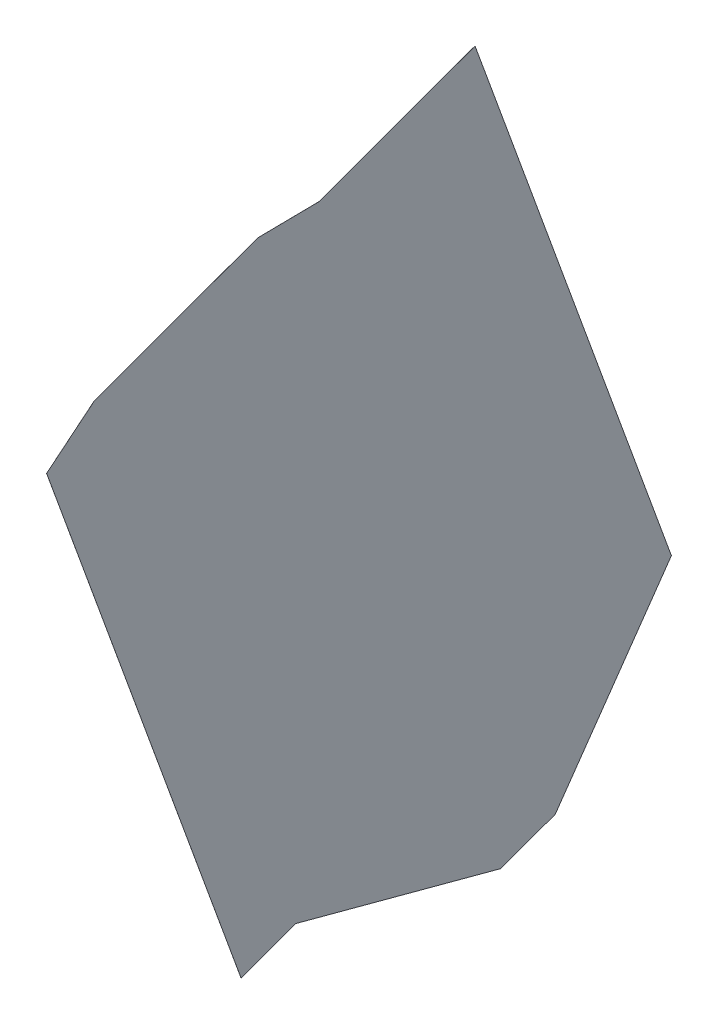
ISO-10303-21;
HEADER;
FILE_DESCRIPTION(('STEP AP214'),'2;1');
FILE_NAME('part.step','',(''),(''),'','','');
FILE_SCHEMA(('AUTOMOTIVE_DESIGN { 1 0 10303 214 1 1 1 1 }'));
ENDSEC;
DATA;
#1=APPLICATION_CONTEXT('core data for automotive mechanical design processes');
#2=APPLICATION_PROTOCOL_DEFINITION('international standard','automotive_design',2000,#1);
#3=PRODUCT_CONTEXT('',#1,'mechanical');
#4=PRODUCT('Part','Part','',(#3));
#5=PRODUCT_RELATED_PRODUCT_CATEGORY('part','',(#4));
#6=PRODUCT_DEFINITION_FORMATION('','',#4);
#7=PRODUCT_DEFINITION_CONTEXT('part definition',#1,'design');
#8=PRODUCT_DEFINITION('design','',#6,#7);
#9=PRODUCT_DEFINITION_SHAPE('','',#8);
#10=(LENGTH_UNIT() NAMED_UNIT(*) SI_UNIT(.MILLI.,.METRE.));
#11=(NAMED_UNIT(*) PLANE_ANGLE_UNIT() SI_UNIT($,.RADIAN.));
#12=(NAMED_UNIT(*) SI_UNIT($,.STERADIAN.) SOLID_ANGLE_UNIT());
#13=UNCERTAINTY_MEASURE_WITH_UNIT(LENGTH_MEASURE(1.E-05),#10,'distance_accuracy_value','');
#14=(GEOMETRIC_REPRESENTATION_CONTEXT(3) GLOBAL_UNCERTAINTY_ASSIGNED_CONTEXT((#13)) GLOBAL_UNIT_ASSIGNED_CONTEXT((#10,
#11,#12)) REPRESENTATION_CONTEXT('',''));
#15=CARTESIAN_POINT('',(0.,0.,0.));
#16=DIRECTION('',(0.,0.,1.));
#17=DIRECTION('',(1.,0.,0.));
#18=AXIS2_PLACEMENT_3D('',#15,#16,#17);
#19=CARTESIAN_POINT('',(140.002211031102,245.581163464748,379.425064512277));
#20=DIRECTION('',(4.24461743529474E-10,0.93968845337996,0.342031592962375));
#21=DIRECTION('',(3.48372728310009E-05,-0.342031592754838,0.939688452809735));
#22=AXIS2_PLACEMENT_3D('',#19,#20,#21);
#23=PLANE('',#22);
#24=DIRECTION('',(-0.999999999393183,-1.19150490591746E-05,3.27363282058429E-05));
#25=VECTOR('',#24,1.);
#26=CARTESIAN_POINT('',(140.004864932661,219.525215240095,451.010479989568));
#27=LINE('',#26,#25);
#28=CARTESIAN_POINT('',(140.014864932655,219.525215359245,451.010479662205));
#29=VERTEX_POINT('',#28);
#30=CARTESIAN_POINT('',(140.004864932661,219.525215240095,451.010479989568));
#31=VERTEX_POINT('',#30);
#32=EDGE_CURVE('E301',#29,#31,#27,.T.);
#33=ORIENTED_EDGE('',*,*,#32,.F.);
#34=DIRECTION('',(3.48372728310009E-05,-0.342031592754838,0.939688452809735));
#35=VECTOR('',#34,1.);
#36=CARTESIAN_POINT('',(140.012211031096,245.581163583898,379.425064184914));
#37=LINE('',#36,#35);
#38=CARTESIAN_POINT('',(140.012211725956,245.574341465387,379.443807090903));
#39=VERTEX_POINT('',#38);
#40=EDGE_CURVE('E291',#39,#29,#37,.T.);
#41=ORIENTED_EDGE('',*,*,#40,.F.);
#42=DIRECTION('',(-0.999999999393183,-1.19150489253927E-05,3.273632792683E-05));
#43=VECTOR('',#42,1.);
#44=CARTESIAN_POINT('',(140.002211725962,245.574341346237,379.443807418266));
#45=LINE('',#44,#43);
#46=CARTESIAN_POINT('',(140.002211725962,245.574341346237,379.443807418266));
#47=VERTEX_POINT('',#46);
#48=EDGE_CURVE('E304',#39,#47,#45,.T.);
#49=ORIENTED_EDGE('',*,*,#48,.T.);
#50=DIRECTION('',(3.48372728310009E-05,-0.342031592754838,0.939688452809735));
#51=VECTOR('',#50,1.);
#52=CARTESIAN_POINT('',(140.002211031102,245.581163464748,379.425064512277));
#53=LINE('',#52,#51);
#54=EDGE_CURVE('E290',#47,#31,#53,.T.);
#55=ORIENTED_EDGE('',*,*,#54,.T.);
#56=EDGE_LOOP('',(#33,#41,#49,#55));
#57=FACE_BOUND('',#56,.T.);
#58=ADVANCED_FACE('F52',(#57),#23,.T.);
#59=CARTESIAN_POINT('',(140.007230519492,-1.25960326254532,442.913203080727));
#60=DIRECTION('',(1.99802265898885E-05,-0.965940446549184,0.258764474611865));
#61=DIRECTION('',(-2.8538152075791E-05,-0.258764475108921,-0.965940446201099));
#62=AXIS2_PLACEMENT_3D('',#59,#60,#61);
#63=PLANE('',#62);
#64=DIRECTION('',(-0.999999999393183,-1.19150490591746E-05,3.27363282058429E-05));
#65=VECTOR('',#64,1.);
#66=CARTESIAN_POINT('',(140.002211725966,-46.7665957623939,273.040408053237));
#67=LINE('',#66,#65);
#68=CARTESIAN_POINT('',(140.01221172596,-46.7665956432434,273.040407725874));
#69=VERTEX_POINT('',#68);
#70=CARTESIAN_POINT('',(140.002211725966,-46.7665957623939,273.040408053237));
#71=VERTEX_POINT('',#70);
#72=EDGE_CURVE('E307',#69,#71,#67,.T.);
#73=ORIENTED_EDGE('',*,*,#72,.F.);
#74=DIRECTION('',(-2.8538152075791E-05,-0.258764475108921,-0.965940446201099));
#75=VECTOR('',#74,1.);
#76=CARTESIAN_POINT('',(140.017230519486,-1.25960314339485,442.913202753364));
#77=LINE('',#76,#75);
#78=CARTESIAN_POINT('',(140.014864932658,-22.7091291039954,362.8443885606));
#79=VERTEX_POINT('',#78);
#80=EDGE_CURVE('E282',#79,#69,#77,.T.);
#81=ORIENTED_EDGE('',*,*,#80,.F.);
#82=DIRECTION('',(-0.999999999393183,-1.19150502450593E-05,3.27363281499987E-05));
#83=VECTOR('',#82,1.);
#84=CARTESIAN_POINT('',(140.004864932664,-22.7091292231458,362.844388887963));
#85=LINE('',#84,#83);
#86=CARTESIAN_POINT('',(140.004864932664,-22.7091292231458,362.844388887963));
#87=VERTEX_POINT('',#86);
#88=EDGE_CURVE('E294',#79,#87,#85,.T.);
#89=ORIENTED_EDGE('',*,*,#88,.T.);
#90=DIRECTION('',(-2.8538152075791E-05,-0.258764475108921,-0.965940446201099));
#91=VECTOR('',#90,1.);
#92=CARTESIAN_POINT('',(140.007230519492,-1.25960326254532,442.913203080727));
#93=LINE('',#92,#91);
#94=EDGE_CURVE('E287',#87,#71,#93,.T.);
#95=ORIENTED_EDGE('',*,*,#94,.T.);
#96=EDGE_LOOP('',(#73,#81,#89,#95));
#97=FACE_BOUND('',#96,.T.);
#98=ADVANCED_FACE('F335',(#97),#63,.T.);
#99=CARTESIAN_POINT('',(140.001327307801,250.082815046131,354.068344712773));
#100=DIRECTION('',(0.999999999393183,1.19150490591161E-05,-3.27363282059733E-05));
#101=DIRECTION('',(-3.27363282082958E-05,0.,-0.999999999464166));
#102=AXIS2_PLACEMENT_3D('',#99,#100,#101);
#103=PLANE('',#102);
#104=ORIENTED_EDGE('',*,*,#54,.F.);
#105=DIRECTION('',(-3.33966870064289E-05,0.0604461376761188,-0.998171459882871));
#106=VECTOR('',#105,1.);
#107=CARTESIAN_POINT('',(140.002211725962,245.574341346237,379.443807418266));
#108=LINE('',#107,#106);
#109=CARTESIAN_POINT('',(140.002210905128,245.575827009733,379.419274057531));
#110=VERTEX_POINT('',#109);
#111=EDGE_CURVE('E234',#47,#110,#108,.T.);
#112=ORIENTED_EDGE('',*,*,#111,.T.);
#113=DIRECTION('',(3.28839724955954E-05,-0.0126098572843799,0.999920492048199));
#114=VECTOR('',#113,1.);
#115=CARTESIAN_POINT('',(140.001374953027,245.896385503545,354.000032615381));
#116=LINE('',#115,#114);
#117=CARTESIAN_POINT('',(140.001327431889,245.914608203497,352.555032034378));
#118=VERTEX_POINT('',#117);
#119=EDGE_CURVE('E226',#118,#110,#116,.T.);
#120=ORIENTED_EDGE('',*,*,#119,.F.);
#121=DIRECTION('',(-3.33964975428604E-05,0.0604271628627157,-0.998172608757141));
#122=VECTOR('',#121,1.);
#123=CARTESIAN_POINT('',(140.001327431889,245.914608203497,352.555032034378));
#124=LINE('',#123,#122);
#125=CARTESIAN_POINT('',(140.001326611055,245.916093409006,352.53049850695));
#126=VERTEX_POINT('',#125);
#127=EDGE_CURVE('E207',#118,#126,#124,.T.);
#128=ORIENTED_EDGE('',*,*,#127,.T.);
#129=DIRECTION('',(3.48372728311041E-05,-0.342008693430631,0.939696787482131));
#130=VECTOR('',#129,1.);
#131=CARTESIAN_POINT('',(140.001327309686,245.909234726901,352.549343295589));
#132=LINE('',#131,#130);
#133=CARTESIAN_POINT('',(139.998796306556,270.756905147957,284.27834165271));
#134=VERTEX_POINT('',#133);
#135=EDGE_CURVE('E187',#134,#126,#132,.T.);
#136=ORIENTED_EDGE('',*,*,#135,.F.);
#137=DIRECTION('',(0.,0.939692620785909,0.342020143325667));
#138=VECTOR('',#137,1.);
#139=CARTESIAN_POINT('',(139.998796306559,-30.3980769516625,174.666892267478));
#140=LINE('',#139,#138);
#141=CARTESIAN_POINT('',(139.998796306559,34.5489302580996,198.305669696504));
#142=VERTEX_POINT('',#141);
#143=EDGE_CURVE('E177',#142,#134,#140,.T.);
#144=ORIENTED_EDGE('',*,*,#143,.F.);
#145=DIRECTION('',(-2.85381520898877E-05,0.81911963874694,-0.573622712769165));
#146=VECTOR('',#145,1.);
#147=CARTESIAN_POINT('',(139.99630780739,105.975367868435,148.286325796808));
#148=LINE('',#147,#146);
#149=CARTESIAN_POINT('',(140.001326611059,-38.0774297678632,249.165309346181));
#150=VERTEX_POINT('',#149);
#151=EDGE_CURVE('E172',#150,#142,#148,.T.);
#152=ORIENTED_EDGE('',*,*,#151,.F.);
#153=DIRECTION('',(2.99482548936302E-05,-0.774077010630948,0.63309144735635));
#154=VECTOR('',#153,1.);
#155=CARTESIAN_POINT('',(140.001326611059,-38.0774297678632,249.165309346181));
#156=LINE('',#155,#154);
#157=CARTESIAN_POINT('',(140.001327431893,-38.0986459841152,249.182661373007));
#158=VERTEX_POINT('',#157);
#159=EDGE_CURVE('E204',#150,#158,#156,.T.);
#160=ORIENTED_EDGE('',*,*,#159,.T.);
#161=DIRECTION('',(-3.48372728232373E-05,0.341997223548684,-0.93970096194021));
#162=VECTOR('',#161,1.);
#163=CARTESIAN_POINT('',(140.001326995727,-38.0943641523678,249.170896244126));
#164=LINE('',#163,#162);
#165=CARTESIAN_POINT('',(140.002210905132,-46.7716955758896,273.013477774899));
#166=VERTEX_POINT('',#165);
#167=EDGE_CURVE('E215',#166,#158,#164,.T.);
#168=ORIENTED_EDGE('',*,*,#167,.F.);
#169=DIRECTION('',(2.99477106180945E-05,0.186064119653789,0.982537603596216));
#170=VECTOR('',#169,1.);
#171=CARTESIAN_POINT('',(140.002210905132,-46.7716955758897,273.0134777749));
#172=LINE('',#171,#170);
#173=EDGE_CURVE('E231',#166,#71,#172,.T.);
#174=ORIENTED_EDGE('',*,*,#173,.T.);
#175=ORIENTED_EDGE('',*,*,#94,.F.);
#176=DIRECTION('',(2.99482548815622E-05,0.186034054389951,0.982543296608521));
#177=VECTOR('',#176,1.);
#178=CARTESIAN_POINT('',(140.004864932664,-22.7091292231457,362.844388887963));
#179=LINE('',#178,#177);
#180=CARTESIAN_POINT('',(140.004865753498,-22.704030326429,362.871318832621));
#181=VERTEX_POINT('',#180);
#182=EDGE_CURVE('E275',#87,#181,#179,.T.);
#183=ORIENTED_EDGE('',*,*,#182,.T.);
#184=DIRECTION('',(-3.48372728231147E-05,0.342043062484098,-0.939684277932149));
#185=VECTOR('',#184,1.);
#186=CARTESIAN_POINT('',(140.005749708233,-31.3829698699853,386.714699777039));
#187=LINE('',#186,#185);
#188=CARTESIAN_POINT('',(140.005749923483,-31.3850832548575,386.720505813633));
#189=VERTEX_POINT('',#188);
#190=EDGE_CURVE('E262',#189,#181,#187,.T.);
#191=ORIENTED_EDGE('',*,*,#190,.F.);
#192=DIRECTION('',(0.,-0.93969262078591,-0.342020143325667));
#193=VECTOR('',#192,1.);
#194=CARTESIAN_POINT('',(140.005749923479,206.663123308001,473.362967322966));
#195=LINE('',#194,#193);
#196=CARTESIAN_POINT('',(140.005749923479,202.488689032755,471.843597501875));
#197=VERTEX_POINT('',#196);
#198=EDGE_CURVE('E267',#197,#189,#195,.T.);
#199=ORIENTED_EDGE('',*,*,#198,.F.);
#200=DIRECTION('',(3.28839725035474E-05,-0.633076791859025,0.774088996516635));
#201=VECTOR('',#200,1.);
#202=CARTESIAN_POINT('',(140.005701695517,203.417165785611,470.708310839736));
#203=LINE('',#202,#201);
#204=CARTESIAN_POINT('',(140.004865753495,219.510583126069,451.030228433624));
#205=VERTEX_POINT('',#204);
#206=EDGE_CURVE('E243',#205,#197,#203,.T.);
#207=ORIENTED_EDGE('',*,*,#206,.F.);
#208=DIRECTION('',(-3.33964975489653E-05,0.595323092897833,-0.803486411799996));
#209=VECTOR('',#208,1.);
#210=CARTESIAN_POINT('',(140.004865753495,219.510583126069,451.030228433624));
#211=LINE('',#210,#209);
#212=EDGE_CURVE('E278',#205,#31,#211,.T.);
#213=ORIENTED_EDGE('',*,*,#212,.T.);
#214=EDGE_LOOP('',(#104,#112,#120,#128,#136,#144,#152,#160,#168,#174,#175,#183,#191,#199,#207,#213));
#215=FACE_BOUND('',#214,.T.);
#216=ADVANCED_FACE('F54',(#215),#103,.F.);
#217=CARTESIAN_POINT('',(140.01221102921,241.406747821996,377.905643500755));
#218=DIRECTION('',(0.999999999393183,1.19150490591746E-05,-3.27363282058429E-05));
#219=DIRECTION('',(-3.27363282165427E-05,0.642787609342109,-0.766044442708508));
#220=AXIS2_PLACEMENT_3D('',#217,#218,#219);
#221=PLANE('',#220);
#222=ORIENTED_EDGE('',*,*,#40,.T.);
#223=DIRECTION('',(-3.33964975489653E-05,0.595323092897833,-0.803486411799996));
#224=VECTOR('',#223,1.);
#225=CARTESIAN_POINT('',(140.014865753489,219.51058324522,451.030228106261));
#226=LINE('',#225,#224);
#227=CARTESIAN_POINT('',(140.014865753489,219.51058324522,451.030228106261));
#228=VERTEX_POINT('',#227);
#229=EDGE_CURVE('E279',#228,#29,#226,.T.);
#230=ORIENTED_EDGE('',*,*,#229,.F.);
#231=DIRECTION('',(3.28839725035474E-05,-0.633076791859025,0.774088996516635));
#232=VECTOR('',#231,1.);
#233=CARTESIAN_POINT('',(140.015701695511,203.417165904761,470.708310512372));
#234=LINE('',#233,#232);
#235=CARTESIAN_POINT('',(140.015749923473,202.488689151905,471.843597174512));
#236=VERTEX_POINT('',#235);
#237=EDGE_CURVE('E258',#228,#236,#234,.T.);
#238=ORIENTED_EDGE('',*,*,#237,.T.);
#239=DIRECTION('',(0.,-0.939692620785914,-0.342020143325656));
#240=VECTOR('',#239,1.);
#241=CARTESIAN_POINT('',(140.015749923473,206.663123427152,473.362966995602));
#242=LINE('',#241,#240);
#243=CARTESIAN_POINT('',(140.015749923476,-31.3850831357069,386.72050548627));
#244=VERTEX_POINT('',#243);
#245=EDGE_CURVE('E254',#236,#244,#242,.T.);
#246=ORIENTED_EDGE('',*,*,#245,.T.);
#247=DIRECTION('',(-3.48372728231147E-05,0.342043062484098,-0.939684277932149));
#248=VECTOR('',#247,1.);
#249=CARTESIAN_POINT('',(140.015749708227,-31.3829697508349,386.714699449675));
#250=LINE('',#249,#248);
#251=CARTESIAN_POINT('',(140.014865753492,-22.7040302072785,362.871318505258));
#252=VERTEX_POINT('',#251);
#253=EDGE_CURVE('E251',#244,#252,#250,.T.);
#254=ORIENTED_EDGE('',*,*,#253,.T.);
#255=DIRECTION('',(2.99482548815622E-05,0.186034054389951,0.982543296608521));
#256=VECTOR('',#255,1.);
#257=CARTESIAN_POINT('',(140.014864932658,-22.7091291039953,362.8443885606));
#258=LINE('',#257,#256);
#259=EDGE_CURVE('E247',#79,#252,#258,.T.);
#260=ORIENTED_EDGE('',*,*,#259,.F.);
#261=ORIENTED_EDGE('',*,*,#80,.T.);
#262=DIRECTION('',(2.99477106180945E-05,0.186064119653789,0.982537603596216));
#263=VECTOR('',#262,1.);
#264=CARTESIAN_POINT('',(140.012210905126,-46.7716954567393,273.013477447536));
#265=LINE('',#264,#263);
#266=CARTESIAN_POINT('',(140.012210905126,-46.771695456739,273.013477447536));
#267=VERTEX_POINT('',#266);
#268=EDGE_CURVE('E218',#267,#69,#265,.T.);
#269=ORIENTED_EDGE('',*,*,#268,.F.);
#270=DIRECTION('',(-3.48372728232373E-05,0.341997223548684,-0.93970096194021));
#271=VECTOR('',#270,1.);
#272=CARTESIAN_POINT('',(140.011326995721,-38.0943640332173,249.170895916763));
#273=LINE('',#272,#271);
#274=CARTESIAN_POINT('',(140.011327431887,-38.0986458649647,249.182661045644));
#275=VERTEX_POINT('',#274);
#276=EDGE_CURVE('E67',#267,#275,#273,.T.);
#277=ORIENTED_EDGE('',*,*,#276,.T.);
#278=DIRECTION('',(2.99482548936302E-05,-0.774077010630948,0.63309144735635));
#279=VECTOR('',#278,1.);
#280=CARTESIAN_POINT('',(140.011326611053,-38.0774296487127,249.165309018817));
#281=LINE('',#280,#279);
#282=CARTESIAN_POINT('',(140.011326611053,-38.077429648713,249.165309018817));
#283=VERTEX_POINT('',#282);
#284=EDGE_CURVE('E185',#283,#275,#281,.T.);
#285=ORIENTED_EDGE('',*,*,#284,.F.);
#286=DIRECTION('',(-2.85381520898877E-05,0.81911963874694,-0.573622712769165));
#287=VECTOR('',#286,1.);
#288=CARTESIAN_POINT('',(140.006307807384,105.975367987585,148.286325469445));
#289=LINE('',#288,#287);
#290=CARTESIAN_POINT('',(140.008796306553,34.5489303772498,198.30566936914));
#291=VERTEX_POINT('',#290);
#292=EDGE_CURVE('E170',#283,#291,#289,.T.);
#293=ORIENTED_EDGE('',*,*,#292,.T.);
#294=DIRECTION('',(0.,0.939692620785909,0.342020143325667));
#295=VECTOR('',#294,1.);
#296=CARTESIAN_POINT('',(140.008796306553,-30.3980768325121,174.666891940115));
#297=LINE('',#296,#295);
#298=CARTESIAN_POINT('',(140.00879630655,270.756905267108,284.278341325347));
#299=VERTEX_POINT('',#298);
#300=EDGE_CURVE('E182',#291,#299,#297,.T.);
#301=ORIENTED_EDGE('',*,*,#300,.T.);
#302=DIRECTION('',(3.48372728311041E-05,-0.342008693430631,0.939696787482131));
#303=VECTOR('',#302,1.);
#304=CARTESIAN_POINT('',(140.01132730968,245.909234846051,352.549342968226));
#305=LINE('',#304,#303);
#306=CARTESIAN_POINT('',(140.011326611049,245.916093528156,352.530498179586));
#307=VERTEX_POINT('',#306);
#308=EDGE_CURVE('E191',#299,#307,#305,.T.);
#309=ORIENTED_EDGE('',*,*,#308,.T.);
#310=DIRECTION('',(-3.33964975428604E-05,0.0604271628627157,-0.998172608757141));
#311=VECTOR('',#310,1.);
#312=CARTESIAN_POINT('',(140.011327431883,245.914608322647,352.555031707015));
#313=LINE('',#312,#311);
#314=CARTESIAN_POINT('',(140.011327431883,245.914608322647,352.555031707015));
#315=VERTEX_POINT('',#314);
#316=EDGE_CURVE('E208',#315,#307,#313,.T.);
#317=ORIENTED_EDGE('',*,*,#316,.F.);
#318=DIRECTION('',(3.28839724955954E-05,-0.0126098572843799,0.999920492048199));
#319=VECTOR('',#318,1.);
#320=CARTESIAN_POINT('',(140.011374953021,245.896385622695,354.000032288018));
#321=LINE('',#320,#319);
#322=CARTESIAN_POINT('',(140.012210905122,245.575827128883,379.419273730168));
#323=VERTEX_POINT('',#322);
#324=EDGE_CURVE('E75',#315,#323,#321,.T.);
#325=ORIENTED_EDGE('',*,*,#324,.T.);
#326=DIRECTION('',(-3.33966870064289E-05,0.0604461376761188,-0.998171459882871));
#327=VECTOR('',#326,1.);
#328=CARTESIAN_POINT('',(140.012211725956,245.574341465387,379.443807090903));
#329=LINE('',#328,#327);
#330=EDGE_CURVE('E235',#39,#323,#329,.T.);
#331=ORIENTED_EDGE('',*,*,#330,.F.);
#332=EDGE_LOOP('',(#222,#230,#238,#246,#254,#260,#261,#269,#277,#285,#293,#301,#309,#317,#325,#331));
#333=FACE_BOUND('',#332,.T.);
#334=ADVANCED_FACE('F181',(#333),#221,.T.);
#335=CARTESIAN_POINT('',(140.009864932661,-22.7091291635705,362.844388724281));
#336=DIRECTION('',(1.77971234437413E-05,-0.982543296992692,0.186034053920228));
#337=DIRECTION('',(2.99482548815622E-05,0.186034054389951,0.982543296608521));
#338=AXIS2_PLACEMENT_3D('',#335,#336,#337);
#339=PLANE('',#338);
#340=ORIENTED_EDGE('',*,*,#88,.F.);
#341=ORIENTED_EDGE('',*,*,#259,.T.);
#342=DIRECTION('',(-0.999999999393182,-1.19150490590081E-05,3.27363282058152E-05));
#343=VECTOR('',#342,1.);
#344=CARTESIAN_POINT('',(140.004865753498,-22.704030326429,362.871318832621));
#345=LINE('',#344,#343);
#346=EDGE_CURVE('E238',#252,#181,#345,.T.);
#347=ORIENTED_EDGE('',*,*,#346,.T.);
#348=ORIENTED_EDGE('',*,*,#182,.F.);
#349=EDGE_LOOP('',(#340,#341,#347,#348));
#350=FACE_BOUND('',#349,.T.);
#351=ADVANCED_FACE('F345',(#350),#339,.T.);
#352=CARTESIAN_POINT('',(140.009865753492,219.510583185645,451.030228269942));
#353=DIRECTION('',(9.9151121426555E-06,0.803486412405705,0.595323092934501));
#354=DIRECTION('',(-3.33964975489653E-05,0.595323092897833,-0.803486411799996));
#355=AXIS2_PLACEMENT_3D('',#352,#353,#354);
#356=PLANE('',#355);
#357=ORIENTED_EDGE('',*,*,#229,.T.);
#358=ORIENTED_EDGE('',*,*,#32,.T.);
#359=ORIENTED_EDGE('',*,*,#212,.F.);
#360=DIRECTION('',(-0.999999999393182,-1.19150487572495E-05,3.27363274589682E-05));
#361=VECTOR('',#360,1.);
#362=CARTESIAN_POINT('',(140.004865753495,219.510583126069,451.030228433624));
#363=LINE('',#362,#361);
#364=EDGE_CURVE('E248',#228,#205,#363,.T.);
#365=ORIENTED_EDGE('',*,*,#364,.F.);
#366=EDGE_LOOP('',(#357,#358,#359,#365));
#367=FACE_BOUND('',#366,.T.);
#368=ADVANCED_FACE('F346',(#367),#356,.T.);
#369=CARTESIAN_POINT('',(140.005749923479,206.663123308001,473.362967322966));
#370=DIRECTION('',(3.4837272833481E-05,-0.342020143118123,0.939692620215687));
#371=DIRECTION('',(0.,-0.93969262078591,-0.342020143325667));
#372=AXIS2_PLACEMENT_3D('',#369,#370,#371);
#373=PLANE('',#372);
#374=DIRECTION('',(-0.999999999393182,-1.19150490590081E-05,3.27363282058152E-05));
#375=VECTOR('',#374,1.);
#376=CARTESIAN_POINT('',(140.005749923483,-31.3850832548575,386.720505813633));
#377=LINE('',#376,#375);
#378=EDGE_CURVE('E265',#244,#189,#377,.T.);
#379=ORIENTED_EDGE('',*,*,#378,.F.);
#380=ORIENTED_EDGE('',*,*,#245,.F.);
#381=DIRECTION('',(-0.999999999393182,-1.19150490590081E-05,3.27363282058152E-05));
#382=VECTOR('',#381,1.);
#383=CARTESIAN_POINT('',(140.005749923479,202.488689032755,471.843597501875));
#384=LINE('',#383,#382);
#385=EDGE_CURVE('E271',#236,#197,#384,.T.);
#386=ORIENTED_EDGE('',*,*,#385,.T.);
#387=ORIENTED_EDGE('',*,*,#198,.T.);
#388=EDGE_LOOP('',(#379,#380,#386,#387));
#389=FACE_BOUND('',#388,.T.);
#390=ADVANCED_FACE('F349',(#389),#373,.T.);
#391=CARTESIAN_POINT('',(140.005749708233,-31.3829698699853,386.714699777039));
#392=DIRECTION('',(-8.49682435518582E-10,-0.939684278502377,-0.342043062691628));
#393=DIRECTION('',(-3.48372728231147E-05,0.342043062484098,-0.939684277932149));
#394=AXIS2_PLACEMENT_3D('',#391,#392,#393);
#395=PLANE('',#394);
#396=ORIENTED_EDGE('',*,*,#346,.F.);
#397=ORIENTED_EDGE('',*,*,#253,.F.);
#398=ORIENTED_EDGE('',*,*,#378,.T.);
#399=ORIENTED_EDGE('',*,*,#190,.T.);
#400=EDGE_LOOP('',(#396,#397,#398,#399));
#401=FACE_BOUND('',#400,.T.);
#402=ADVANCED_FACE('F358',(#401),#395,.T.);
#403=CARTESIAN_POINT('',(140.005701695517,203.417165785611,470.708310839736));
#404=DIRECTION('',(1.15013012680909E-05,0.774088997123404,0.633076791866676));
#405=DIRECTION('',(3.28839725035474E-05,-0.633076791859025,0.774088996516635));
#406=AXIS2_PLACEMENT_3D('',#403,#404,#405);
#407=PLANE('',#406);
#408=ORIENTED_EDGE('',*,*,#385,.F.);
#409=ORIENTED_EDGE('',*,*,#237,.F.);
#410=ORIENTED_EDGE('',*,*,#364,.T.);
#411=ORIENTED_EDGE('',*,*,#206,.T.);
#412=EDGE_LOOP('',(#408,#409,#410,#411));
#413=FACE_BOUND('',#412,.T.);
#414=ADVANCED_FACE('F354',(#413),#407,.T.);
#415=CARTESIAN_POINT('',(140.007210905129,-46.7716955163145,273.013477611218));
#416=DIRECTION('',(1.7798039837591E-05,-0.982537603980373,0.186064119184053));
#417=DIRECTION('',(2.99477106180945E-05,0.186064119653789,0.982537603596216));
#418=AXIS2_PLACEMENT_3D('',#415,#416,#417);
#419=PLANE('',#418);
#420=DIRECTION('',(-0.999999999393182,-1.1915049332456E-05,3.27363291022231E-05));
#421=VECTOR('',#420,1.);
#422=CARTESIAN_POINT('',(140.002210905132,-46.7716955758896,273.013477774899));
#423=LINE('',#422,#421);
#424=EDGE_CURVE('E219',#267,#166,#423,.T.);
#425=ORIENTED_EDGE('',*,*,#424,.F.);
#426=ORIENTED_EDGE('',*,*,#268,.T.);
#427=ORIENTED_EDGE('',*,*,#72,.T.);
#428=ORIENTED_EDGE('',*,*,#173,.F.);
#429=EDGE_LOOP('',(#425,#426,#427,#428));
#430=FACE_BOUND('',#429,.T.);
#431=ADVANCED_FACE('F357',(#430),#419,.T.);
#432=CARTESIAN_POINT('',(140.007211725959,245.574341405812,379.443807254585));
#433=DIRECTION('',(-9.91447731218953E-06,0.998171460370448,0.0604461380373621));
#434=DIRECTION('',(-3.33966870064289E-05,0.0604461376761188,-0.998171459882871));
#435=AXIS2_PLACEMENT_3D('',#432,#433,#434);
#436=PLANE('',#435);
#437=ORIENTED_EDGE('',*,*,#330,.T.);
#438=DIRECTION('',(-0.999999999393182,-1.19150490591746E-05,3.27363282058568E-05));
#439=VECTOR('',#438,1.);
#440=CARTESIAN_POINT('',(140.002210905128,245.575827009733,379.419274057531));
#441=LINE('',#440,#439);
#442=EDGE_CURVE('E211',#323,#110,#441,.T.);
#443=ORIENTED_EDGE('',*,*,#442,.T.);
#444=ORIENTED_EDGE('',*,*,#111,.F.);
#445=ORIENTED_EDGE('',*,*,#48,.F.);
#446=EDGE_LOOP('',(#437,#443,#444,#445));
#447=FACE_BOUND('',#446,.T.);
#448=ADVANCED_FACE('F320',(#447),#436,.T.);
#449=CARTESIAN_POINT('',(140.001374953027,245.896385503545,354.000032615381));
#450=DIRECTION('',(-1.15013012911835E-05,0.99992049251793,0.0126098576685422));
#451=DIRECTION('',(3.28839724955954E-05,-0.0126098572843799,0.999920492048199));
#452=AXIS2_PLACEMENT_3D('',#449,#450,#451);
#453=PLANE('',#452);
#454=ORIENTED_EDGE('',*,*,#442,.F.);
#455=ORIENTED_EDGE('',*,*,#324,.F.);
#456=DIRECTION('',(-0.999999999393182,-1.19150493016473E-05,3.27363287376814E-05));
#457=VECTOR('',#456,1.);
#458=CARTESIAN_POINT('',(140.001327431889,245.914608203497,352.555032034378));
#459=LINE('',#458,#457);
#460=EDGE_CURVE('E60',#315,#118,#459,.T.);
#461=ORIENTED_EDGE('',*,*,#460,.T.);
#462=ORIENTED_EDGE('',*,*,#119,.T.);
#463=EDGE_LOOP('',(#454,#455,#461,#462));
#464=FACE_BOUND('',#463,.T.);
#465=ADVANCED_FACE('F310',(#464),#453,.T.);
#466=CARTESIAN_POINT('',(140.001326995727,-38.0943641523678,249.170896244126));
#467=DIRECTION('',(8.49706749407903E-10,-0.939700962510428,-0.341997223756242));
#468=DIRECTION('',(-3.48372728232373E-05,0.341997223548684,-0.93970096194021));
#469=AXIS2_PLACEMENT_3D('',#466,#467,#468);
#470=PLANE('',#469);
#471=DIRECTION('',(-0.999999999393182,-1.19150490591746E-05,3.27363282058568E-05));
#472=VECTOR('',#471,1.);
#473=CARTESIAN_POINT('',(140.001327431893,-38.0986459841152,249.182661373007));
#474=LINE('',#473,#472);
#475=EDGE_CURVE('E12',#275,#158,#474,.T.);
#476=ORIENTED_EDGE('',*,*,#475,.F.);
#477=ORIENTED_EDGE('',*,*,#276,.F.);
#478=ORIENTED_EDGE('',*,*,#424,.T.);
#479=ORIENTED_EDGE('',*,*,#167,.T.);
#480=EDGE_LOOP('',(#476,#477,#478,#479));
#481=FACE_BOUND('',#480,.T.);
#482=ADVANCED_FACE('F371',(#481),#470,.T.);
#483=CARTESIAN_POINT('',(140.006326611056,-38.077429708288,249.165309182499));
#484=DIRECTION('',(-1.77971234225556E-05,-0.633091447952575,-0.774077010518059));
#485=DIRECTION('',(2.99482548936302E-05,-0.774077010630948,0.63309144735635));
#486=AXIS2_PLACEMENT_3D('',#483,#484,#485);
#487=PLANE('',#486);
#488=DIRECTION('',(-0.999999999393182,-1.19150467270457E-05,3.27363233743202E-05));
#489=VECTOR('',#488,1.);
#490=CARTESIAN_POINT('',(140.001326611059,-38.0774297678632,249.165309346181));
#491=LINE('',#490,#489);
#492=EDGE_CURVE('E194',#283,#150,#491,.T.);
#493=ORIENTED_EDGE('',*,*,#492,.F.);
#494=ORIENTED_EDGE('',*,*,#284,.T.);
#495=ORIENTED_EDGE('',*,*,#475,.T.);
#496=ORIENTED_EDGE('',*,*,#159,.F.);
#497=EDGE_LOOP('',(#493,#494,#495,#496));
#498=FACE_BOUND('',#497,.T.);
#499=ADVANCED_FACE('F374',(#498),#487,.T.);
#500=CARTESIAN_POINT('',(140.006327431886,245.914608263072,352.555031870696));
#501=DIRECTION('',(-9.91511216677755E-06,0.998172609244711,0.0604271632239683));
#502=DIRECTION('',(-3.33964975428604E-05,0.0604271628627157,-0.998172608757141));
#503=AXIS2_PLACEMENT_3D('',#500,#501,#502);
#504=PLANE('',#503);
#505=ORIENTED_EDGE('',*,*,#316,.T.);
#506=DIRECTION('',(-0.999999999393183,-1.19150490591161E-05,3.27363282059733E-05));
#507=VECTOR('',#506,1.);
#508=CARTESIAN_POINT('',(140.001326611055,245.916093409006,352.530498506949));
#509=LINE('',#508,#507);
#510=EDGE_CURVE('E178',#307,#126,#509,.T.);
#511=ORIENTED_EDGE('',*,*,#510,.T.);
#512=ORIENTED_EDGE('',*,*,#127,.F.);
#513=ORIENTED_EDGE('',*,*,#460,.F.);
#514=EDGE_LOOP('',(#505,#511,#512,#513));
#515=FACE_BOUND('',#514,.T.);
#516=ADVANCED_FACE('F313',(#515),#504,.T.);
#517=CARTESIAN_POINT('',(139.998796306559,-30.3980769516625,174.666892267478));
#518=DIRECTION('',(-3.48372728337099E-05,0.342020143118123,-0.939692620215687));
#519=DIRECTION('',(0.,0.939692620785909,0.342020143325667));
#520=AXIS2_PLACEMENT_3D('',#517,#518,#519);
#521=PLANE('',#520);
#522=DIRECTION('',(-0.999999999393183,-1.19150490591161E-05,3.27363282059733E-05));
#523=VECTOR('',#522,1.);
#524=CARTESIAN_POINT('',(139.998796306556,270.756905147957,284.27834165271));
#525=LINE('',#524,#523);
#526=EDGE_CURVE('E190',#299,#134,#525,.T.);
#527=ORIENTED_EDGE('',*,*,#526,.F.);
#528=ORIENTED_EDGE('',*,*,#300,.F.);
#529=DIRECTION('',(-0.999999999393183,-1.19150490591161E-05,3.27363282059733E-05));
#530=VECTOR('',#529,1.);
#531=CARTESIAN_POINT('',(139.998796306559,34.5489302580996,198.305669696504));
#532=LINE('',#531,#530);
#533=EDGE_CURVE('E166',#291,#142,#532,.T.);
#534=ORIENTED_EDGE('',*,*,#533,.T.);
#535=ORIENTED_EDGE('',*,*,#143,.T.);
#536=EDGE_LOOP('',(#527,#528,#534,#535));
#537=FACE_BOUND('',#536,.T.);
#538=ADVANCED_FACE('F189',(#537),#521,.T.);
#539=CARTESIAN_POINT('',(140.001327309686,245.909234726901,352.549343295589));
#540=DIRECTION('',(-4.24486102128583E-10,0.939696788052351,0.342008693638182));
#541=DIRECTION('',(3.48372728311041E-05,-0.342008693430631,0.939696787482131));
#542=AXIS2_PLACEMENT_3D('',#539,#540,#541);
#543=PLANE('',#542);
#544=ORIENTED_EDGE('',*,*,#510,.F.);
#545=ORIENTED_EDGE('',*,*,#308,.F.);
#546=ORIENTED_EDGE('',*,*,#526,.T.);
#547=ORIENTED_EDGE('',*,*,#135,.T.);
#548=EDGE_LOOP('',(#544,#545,#546,#547));
#549=FACE_BOUND('',#548,.T.);
#550=ADVANCED_FACE('F325',(#549),#543,.T.);
#551=CARTESIAN_POINT('',(139.99630780739,105.975367868435,148.286325796808));
#552=DIRECTION('',(-1.99802265699102E-05,-0.573622713355316,-0.819119638589917));
#553=DIRECTION('',(-2.85381520898877E-05,0.81911963874694,-0.573622712769165));
#554=AXIS2_PLACEMENT_3D('',#551,#552,#553);
#555=PLANE('',#554);
#556=ORIENTED_EDGE('',*,*,#533,.F.);
#557=ORIENTED_EDGE('',*,*,#292,.F.);
#558=ORIENTED_EDGE('',*,*,#492,.T.);
#559=ORIENTED_EDGE('',*,*,#151,.T.);
#560=EDGE_LOOP('',(#556,#557,#558,#559));
#561=FACE_BOUND('',#560,.T.);
#562=ADVANCED_FACE('F168',(#561),#555,.T.);
#563=CLOSED_SHELL('',(#58,#98,#216,#334,#351,#368,#390,#402,#414,#431,#448,#465,#482,#499,#516,
#538,#550,#562));
#564=MANIFOLD_SOLID_BREP('B2',#563);
#565=ADVANCED_BREP_SHAPE_REPRESENTATION('',(#18,#564),#14);
#566=SHAPE_DEFINITION_REPRESENTATION(#9,#565);
ENDSEC;
END-ISO-10303-21;
